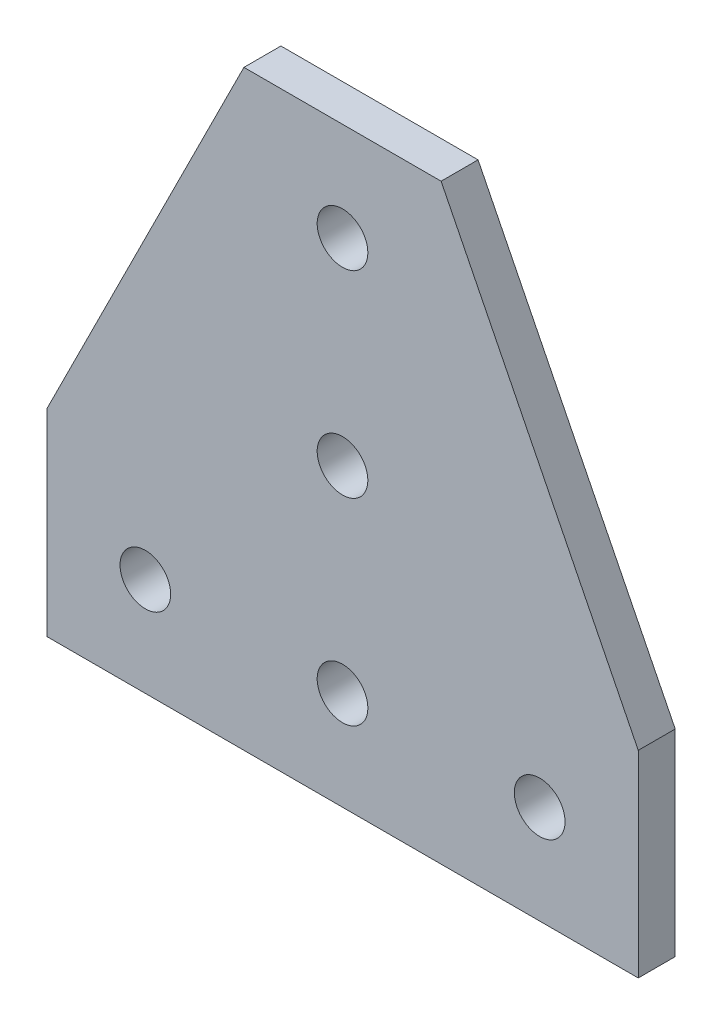
ISO-10303-21;
HEADER;
FILE_DESCRIPTION(('STEP AP214'),'2;1');
FILE_NAME('part.step','',(''),(''),'','','');
FILE_SCHEMA(('AUTOMOTIVE_DESIGN { 1 0 10303 214 1 1 1 1 }'));
ENDSEC;
DATA;
#1=APPLICATION_CONTEXT('core data for automotive mechanical design processes');
#2=APPLICATION_PROTOCOL_DEFINITION('international standard','automotive_design',2000,#1);
#3=PRODUCT_CONTEXT('',#1,'mechanical');
#4=PRODUCT('Part','Part','',(#3));
#5=PRODUCT_RELATED_PRODUCT_CATEGORY('part','',(#4));
#6=PRODUCT_DEFINITION_FORMATION('','',#4);
#7=PRODUCT_DEFINITION_CONTEXT('part definition',#1,'design');
#8=PRODUCT_DEFINITION('design','',#6,#7);
#9=PRODUCT_DEFINITION_SHAPE('','',#8);
#10=(LENGTH_UNIT() NAMED_UNIT(*) SI_UNIT(.MILLI.,.METRE.));
#11=(NAMED_UNIT(*) PLANE_ANGLE_UNIT() SI_UNIT($,.RADIAN.));
#12=(NAMED_UNIT(*) SI_UNIT($,.STERADIAN.) SOLID_ANGLE_UNIT());
#13=UNCERTAINTY_MEASURE_WITH_UNIT(LENGTH_MEASURE(1.E-05),#10,'distance_accuracy_value','');
#14=(GEOMETRIC_REPRESENTATION_CONTEXT(3) GLOBAL_UNCERTAINTY_ASSIGNED_CONTEXT((#13)) GLOBAL_UNIT_ASSIGNED_CONTEXT((#10,
#11,#12)) REPRESENTATION_CONTEXT('',''));
#15=CARTESIAN_POINT('',(0.,0.,0.));
#16=DIRECTION('',(0.,0.,1.));
#17=DIRECTION('',(1.,0.,0.));
#18=AXIS2_PLACEMENT_3D('',#15,#16,#17);
#19=CARTESIAN_POINT('',(0.,0.,2.38125));
#20=DIRECTION('',(0.,0.,-1.));
#21=DIRECTION('',(-1.,0.,0.));
#22=AXIS2_PLACEMENT_3D('',#19,#20,#21);
#23=PLANE('',#22);
#24=CARTESIAN_POINT('',(38.1,63.5,2.38125));
#25=DIRECTION('',(0.,0.,1.));
#26=DIRECTION('',(1.,0.,0.));
#27=AXIS2_PLACEMENT_3D('',#24,#25,#26);
#28=CIRCLE('',#27,3.26390000000001);
#29=CARTESIAN_POINT('',(41.3639,63.5,2.38125));
#30=VERTEX_POINT('',#29);
#31=EDGE_CURVE('E200',#30,#30,#28,.T.);
#32=ORIENTED_EDGE('',*,*,#31,.F.);
#33=EDGE_LOOP('',(#32));
#34=FACE_BOUND('',#33,.T.);
#35=CARTESIAN_POINT('',(38.1,12.7,2.38125));
#36=DIRECTION('',(0.,0.,1.));
#37=DIRECTION('',(1.,0.,0.));
#38=AXIS2_PLACEMENT_3D('',#35,#36,#37);
#39=CIRCLE('',#38,3.26389999999999);
#40=CARTESIAN_POINT('',(41.3639,12.7,2.38125));
#41=VERTEX_POINT('',#40);
#42=EDGE_CURVE('E212',#41,#41,#39,.T.);
#43=ORIENTED_EDGE('',*,*,#42,.F.);
#44=EDGE_LOOP('',(#43));
#45=FACE_BOUND('',#44,.T.);
#46=DIRECTION('',(1.,0.,0.));
#47=VECTOR('',#46,1.);
#48=CARTESIAN_POINT('',(76.2,0.,2.38125));
#49=LINE('',#48,#47);
#50=CARTESIAN_POINT('',(0.,0.,2.38125));
#51=VERTEX_POINT('',#50);
#52=CARTESIAN_POINT('',(76.2,0.,2.38125));
#53=VERTEX_POINT('',#52);
#54=EDGE_CURVE('E135',#51,#53,#49,.T.);
#55=ORIENTED_EDGE('',*,*,#54,.T.);
#56=DIRECTION('',(0.,1.,0.));
#57=VECTOR('',#56,1.);
#58=CARTESIAN_POINT('',(76.2,25.4,2.38125));
#59=LINE('',#58,#57);
#60=CARTESIAN_POINT('',(76.2,25.4,2.38125));
#61=VERTEX_POINT('',#60);
#62=EDGE_CURVE('E93',#53,#61,#59,.T.);
#63=ORIENTED_EDGE('',*,*,#62,.T.);
#64=DIRECTION('',(-0.447213595499958,0.894427190999916,0.));
#65=VECTOR('',#64,1.);
#66=CARTESIAN_POINT('',(76.2,25.4,2.38125));
#67=LINE('',#66,#65);
#68=CARTESIAN_POINT('',(50.8,76.2,2.38125));
#69=VERTEX_POINT('',#68);
#70=EDGE_CURVE('E106',#61,#69,#67,.T.);
#71=ORIENTED_EDGE('',*,*,#70,.T.);
#72=DIRECTION('',(-1.,0.,0.));
#73=VECTOR('',#72,1.);
#74=CARTESIAN_POINT('',(25.4,76.2,2.38125));
#75=LINE('',#74,#73);
#76=CARTESIAN_POINT('',(25.4,76.2,2.38125));
#77=VERTEX_POINT('',#76);
#78=EDGE_CURVE('E100',#69,#77,#75,.T.);
#79=ORIENTED_EDGE('',*,*,#78,.T.);
#80=DIRECTION('',(-0.447213595499958,-0.894427190999916,0.));
#81=VECTOR('',#80,1.);
#82=CARTESIAN_POINT('',(0.,25.4,2.38125));
#83=LINE('',#82,#81);
#84=CARTESIAN_POINT('',(0.,25.4,2.38125));
#85=VERTEX_POINT('',#84);
#86=EDGE_CURVE('E104',#77,#85,#83,.T.);
#87=ORIENTED_EDGE('',*,*,#86,.T.);
#88=DIRECTION('',(0.,-1.,0.));
#89=VECTOR('',#88,1.);
#90=CARTESIAN_POINT('',(0.,0.,2.38125));
#91=LINE('',#90,#89);
#92=EDGE_CURVE('E56',#85,#51,#91,.T.);
#93=ORIENTED_EDGE('',*,*,#92,.T.);
#94=EDGE_LOOP('',(#55,#63,#71,#79,#87,#93));
#95=FACE_BOUND('',#94,.T.);
#96=CARTESIAN_POINT('',(12.7,12.7,2.38125));
#97=DIRECTION('',(0.,0.,1.));
#98=DIRECTION('',(1.,0.,0.));
#99=AXIS2_PLACEMENT_3D('',#96,#97,#98);
#100=CIRCLE('',#99,3.2639);
#101=CARTESIAN_POINT('',(15.9639,12.7,2.38125));
#102=VERTEX_POINT('',#101);
#103=EDGE_CURVE('E128',#102,#102,#100,.T.);
#104=ORIENTED_EDGE('',*,*,#103,.F.);
#105=EDGE_LOOP('',(#104));
#106=FACE_BOUND('',#105,.T.);
#107=CARTESIAN_POINT('',(63.5,12.7,2.38125));
#108=DIRECTION('',(0.,0.,1.));
#109=DIRECTION('',(1.,0.,0.));
#110=AXIS2_PLACEMENT_3D('',#107,#108,#109);
#111=CIRCLE('',#110,3.26389999999999);
#112=CARTESIAN_POINT('',(66.7639,12.7,2.38125));
#113=VERTEX_POINT('',#112);
#114=EDGE_CURVE('E206',#113,#113,#111,.T.);
#115=ORIENTED_EDGE('',*,*,#114,.F.);
#116=EDGE_LOOP('',(#115));
#117=FACE_BOUND('',#116,.T.);
#118=CARTESIAN_POINT('',(38.1,38.1,2.38125));
#119=DIRECTION('',(0.,0.,1.));
#120=DIRECTION('',(1.,0.,0.));
#121=AXIS2_PLACEMENT_3D('',#118,#119,#120);
#122=CIRCLE('',#121,3.26389999999999);
#123=CARTESIAN_POINT('',(41.3639,38.1,2.38125));
#124=VERTEX_POINT('',#123);
#125=EDGE_CURVE('E191',#124,#124,#122,.T.);
#126=ORIENTED_EDGE('',*,*,#125,.F.);
#127=EDGE_LOOP('',(#126));
#128=FACE_BOUND('',#127,.T.);
#129=ADVANCED_FACE('F39',(#34,#45,#95,#106,#117,#128),#23,.F.);
#130=CARTESIAN_POINT('',(0.,0.,-2.38125));
#131=DIRECTION('',(0.,0.,-1.));
#132=DIRECTION('',(-1.,0.,0.));
#133=AXIS2_PLACEMENT_3D('',#130,#131,#132);
#134=PLANE('',#133);
#135=CARTESIAN_POINT('',(38.1,63.5,-2.38125));
#136=DIRECTION('',(0.,0.,1.));
#137=DIRECTION('',(1.,0.,0.));
#138=AXIS2_PLACEMENT_3D('',#135,#136,#137);
#139=CIRCLE('',#138,3.26390000000001);
#140=CARTESIAN_POINT('',(41.3639,63.5,-2.38125));
#141=VERTEX_POINT('',#140);
#142=EDGE_CURVE('E197',#141,#141,#139,.T.);
#143=ORIENTED_EDGE('',*,*,#142,.T.);
#144=EDGE_LOOP('',(#143));
#145=FACE_BOUND('',#144,.T.);
#146=CARTESIAN_POINT('',(38.1,12.7,-2.38125));
#147=DIRECTION('',(0.,0.,1.));
#148=DIRECTION('',(1.,0.,0.));
#149=AXIS2_PLACEMENT_3D('',#146,#147,#148);
#150=CIRCLE('',#149,3.26389999999999);
#151=CARTESIAN_POINT('',(41.3639,12.7,-2.38125));
#152=VERTEX_POINT('',#151);
#153=EDGE_CURVE('E209',#152,#152,#150,.T.);
#154=ORIENTED_EDGE('',*,*,#153,.T.);
#155=EDGE_LOOP('',(#154));
#156=FACE_BOUND('',#155,.T.);
#157=DIRECTION('',(1.,0.,0.));
#158=VECTOR('',#157,1.);
#159=CARTESIAN_POINT('',(76.2,0.,-2.38125));
#160=LINE('',#159,#158);
#161=CARTESIAN_POINT('',(0.,0.,-2.38125));
#162=VERTEX_POINT('',#161);
#163=CARTESIAN_POINT('',(76.2,0.,-2.38125));
#164=VERTEX_POINT('',#163);
#165=EDGE_CURVE('E124',#162,#164,#160,.T.);
#166=ORIENTED_EDGE('',*,*,#165,.F.);
#167=DIRECTION('',(0.,-1.,0.));
#168=VECTOR('',#167,1.);
#169=CARTESIAN_POINT('',(0.,0.,-2.38125));
#170=LINE('',#169,#168);
#171=CARTESIAN_POINT('',(0.,25.4,-2.38125));
#172=VERTEX_POINT('',#171);
#173=EDGE_CURVE('E85',#172,#162,#170,.T.);
#174=ORIENTED_EDGE('',*,*,#173,.F.);
#175=DIRECTION('',(-0.447213595499958,-0.894427190999916,0.));
#176=VECTOR('',#175,1.);
#177=CARTESIAN_POINT('',(0.,25.4,-2.38125));
#178=LINE('',#177,#176);
#179=CARTESIAN_POINT('',(25.4,76.2,-2.38125));
#180=VERTEX_POINT('',#179);
#181=EDGE_CURVE('E79',#180,#172,#178,.T.);
#182=ORIENTED_EDGE('',*,*,#181,.F.);
#183=DIRECTION('',(-1.,0.,0.));
#184=VECTOR('',#183,1.);
#185=CARTESIAN_POINT('',(25.4,76.2,-2.38125));
#186=LINE('',#185,#184);
#187=CARTESIAN_POINT('',(50.8,76.2,-2.38125));
#188=VERTEX_POINT('',#187);
#189=EDGE_CURVE('E114',#188,#180,#186,.T.);
#190=ORIENTED_EDGE('',*,*,#189,.F.);
#191=DIRECTION('',(-0.447213595499958,0.894427190999916,0.));
#192=VECTOR('',#191,1.);
#193=CARTESIAN_POINT('',(76.2,25.4,-2.38125));
#194=LINE('',#193,#192);
#195=CARTESIAN_POINT('',(76.2,25.4,-2.38125));
#196=VERTEX_POINT('',#195);
#197=EDGE_CURVE('E130',#196,#188,#194,.T.);
#198=ORIENTED_EDGE('',*,*,#197,.F.);
#199=DIRECTION('',(0.,1.,0.));
#200=VECTOR('',#199,1.);
#201=CARTESIAN_POINT('',(76.2,25.4,-2.38125));
#202=LINE('',#201,#200);
#203=EDGE_CURVE('E127',#164,#196,#202,.T.);
#204=ORIENTED_EDGE('',*,*,#203,.F.);
#205=EDGE_LOOP('',(#166,#174,#182,#190,#198,#204));
#206=FACE_BOUND('',#205,.T.);
#207=CARTESIAN_POINT('',(12.7,12.7,-2.38125));
#208=DIRECTION('',(0.,0.,1.));
#209=DIRECTION('',(1.,0.,0.));
#210=AXIS2_PLACEMENT_3D('',#207,#208,#209);
#211=CIRCLE('',#210,3.2639);
#212=CARTESIAN_POINT('',(15.9639,12.7,-2.38125));
#213=VERTEX_POINT('',#212);
#214=EDGE_CURVE('E215',#213,#213,#211,.T.);
#215=ORIENTED_EDGE('',*,*,#214,.T.);
#216=EDGE_LOOP('',(#215));
#217=FACE_BOUND('',#216,.T.);
#218=CARTESIAN_POINT('',(63.5,12.7,-2.38125));
#219=DIRECTION('',(0.,0.,1.));
#220=DIRECTION('',(1.,0.,0.));
#221=AXIS2_PLACEMENT_3D('',#218,#219,#220);
#222=CIRCLE('',#221,3.26389999999999);
#223=CARTESIAN_POINT('',(66.7639,12.7,-2.38125));
#224=VERTEX_POINT('',#223);
#225=EDGE_CURVE('E203',#224,#224,#222,.T.);
#226=ORIENTED_EDGE('',*,*,#225,.T.);
#227=EDGE_LOOP('',(#226));
#228=FACE_BOUND('',#227,.T.);
#229=CARTESIAN_POINT('',(38.1,38.1,-2.38125));
#230=DIRECTION('',(0.,0.,1.));
#231=DIRECTION('',(1.,0.,0.));
#232=AXIS2_PLACEMENT_3D('',#229,#230,#231);
#233=CIRCLE('',#232,3.26389999999999);
#234=CARTESIAN_POINT('',(41.3639,38.1,-2.38125));
#235=VERTEX_POINT('',#234);
#236=EDGE_CURVE('E194',#235,#235,#233,.T.);
#237=ORIENTED_EDGE('',*,*,#236,.T.);
#238=EDGE_LOOP('',(#237));
#239=FACE_BOUND('',#238,.T.);
#240=ADVANCED_FACE('F144',(#145,#156,#206,#217,#228,#239),#134,.T.);
#241=CARTESIAN_POINT('',(76.2,0.,2.38125));
#242=DIRECTION('',(0.,1.,0.));
#243=DIRECTION('',(-1.,0.,0.));
#244=AXIS2_PLACEMENT_3D('',#241,#242,#243);
#245=PLANE('',#244);
#246=ORIENTED_EDGE('',*,*,#165,.T.);
#247=DIRECTION('',(0.,0.,-1.));
#248=VECTOR('',#247,1.);
#249=CARTESIAN_POINT('',(76.2,0.,2.38125));
#250=LINE('',#249,#248);
#251=EDGE_CURVE('E11',#53,#164,#250,.T.);
#252=ORIENTED_EDGE('',*,*,#251,.F.);
#253=ORIENTED_EDGE('',*,*,#54,.F.);
#254=DIRECTION('',(0.,0.,-1.));
#255=VECTOR('',#254,1.);
#256=CARTESIAN_POINT('',(0.,0.,2.38125));
#257=LINE('',#256,#255);
#258=EDGE_CURVE('E120',#51,#162,#257,.T.);
#259=ORIENTED_EDGE('',*,*,#258,.T.);
#260=EDGE_LOOP('',(#246,#252,#253,#259));
#261=FACE_BOUND('',#260,.T.);
#262=ADVANCED_FACE('F41',(#261),#245,.F.);
#263=CARTESIAN_POINT('',(76.2,25.4,2.38125));
#264=DIRECTION('',(-1.,0.,0.));
#265=DIRECTION('',(0.,0.,1.));
#266=AXIS2_PLACEMENT_3D('',#263,#264,#265);
#267=PLANE('',#266);
#268=ORIENTED_EDGE('',*,*,#203,.T.);
#269=DIRECTION('',(0.,0.,-1.));
#270=VECTOR('',#269,1.);
#271=CARTESIAN_POINT('',(76.2,25.4,2.38125));
#272=LINE('',#271,#270);
#273=EDGE_CURVE('E48',#61,#196,#272,.T.);
#274=ORIENTED_EDGE('',*,*,#273,.F.);
#275=ORIENTED_EDGE('',*,*,#62,.F.);
#276=ORIENTED_EDGE('',*,*,#251,.T.);
#277=EDGE_LOOP('',(#268,#274,#275,#276));
#278=FACE_BOUND('',#277,.T.);
#279=ADVANCED_FACE('F281',(#278),#267,.F.);
#280=CARTESIAN_POINT('',(76.2,25.4,2.38125));
#281=DIRECTION('',(-0.894427190999916,-0.447213595499958,0.));
#282=DIRECTION('',(0.447213595499958,-0.894427190999916,0.));
#283=AXIS2_PLACEMENT_3D('',#280,#281,#282);
#284=PLANE('',#283);
#285=ORIENTED_EDGE('',*,*,#197,.T.);
#286=DIRECTION('',(0.,0.,-1.));
#287=VECTOR('',#286,1.);
#288=CARTESIAN_POINT('',(50.8,76.2,2.38125));
#289=LINE('',#288,#287);
#290=EDGE_CURVE('E115',#69,#188,#289,.T.);
#291=ORIENTED_EDGE('',*,*,#290,.F.);
#292=ORIENTED_EDGE('',*,*,#70,.F.);
#293=ORIENTED_EDGE('',*,*,#273,.T.);
#294=EDGE_LOOP('',(#285,#291,#292,#293));
#295=FACE_BOUND('',#294,.T.);
#296=ADVANCED_FACE('F141',(#295),#284,.F.);
#297=CARTESIAN_POINT('',(25.4,76.2,2.38125));
#298=DIRECTION('',(0.,-1.,0.));
#299=DIRECTION('',(0.,0.,-1.));
#300=AXIS2_PLACEMENT_3D('',#297,#298,#299);
#301=PLANE('',#300);
#302=ORIENTED_EDGE('',*,*,#189,.T.);
#303=DIRECTION('',(0.,0.,-1.));
#304=VECTOR('',#303,1.);
#305=CARTESIAN_POINT('',(25.4,76.2,2.38125));
#306=LINE('',#305,#304);
#307=EDGE_CURVE('E111',#77,#180,#306,.T.);
#308=ORIENTED_EDGE('',*,*,#307,.F.);
#309=ORIENTED_EDGE('',*,*,#78,.F.);
#310=ORIENTED_EDGE('',*,*,#290,.T.);
#311=EDGE_LOOP('',(#302,#308,#309,#310));
#312=FACE_BOUND('',#311,.T.);
#313=ADVANCED_FACE('F112',(#312),#301,.F.);
#314=CARTESIAN_POINT('',(0.,25.4,2.38125));
#315=DIRECTION('',(0.894427190999916,-0.447213595499958,0.));
#316=DIRECTION('',(0.447213595499958,0.894427190999916,0.));
#317=AXIS2_PLACEMENT_3D('',#314,#315,#316);
#318=PLANE('',#317);
#319=ORIENTED_EDGE('',*,*,#181,.T.);
#320=DIRECTION('',(0.,0.,-1.));
#321=VECTOR('',#320,1.);
#322=CARTESIAN_POINT('',(0.,25.4,2.38125));
#323=LINE('',#322,#321);
#324=EDGE_CURVE('E116',#85,#172,#323,.T.);
#325=ORIENTED_EDGE('',*,*,#324,.F.);
#326=ORIENTED_EDGE('',*,*,#86,.F.);
#327=ORIENTED_EDGE('',*,*,#307,.T.);
#328=EDGE_LOOP('',(#319,#325,#326,#327));
#329=FACE_BOUND('',#328,.T.);
#330=ADVANCED_FACE('F118',(#329),#318,.F.);
#331=CARTESIAN_POINT('',(0.,0.,2.38125));
#332=DIRECTION('',(1.,0.,0.));
#333=DIRECTION('',(0.,0.,-1.));
#334=AXIS2_PLACEMENT_3D('',#331,#332,#333);
#335=PLANE('',#334);
#336=ORIENTED_EDGE('',*,*,#173,.T.);
#337=ORIENTED_EDGE('',*,*,#258,.F.);
#338=ORIENTED_EDGE('',*,*,#92,.F.);
#339=ORIENTED_EDGE('',*,*,#324,.T.);
#340=EDGE_LOOP('',(#336,#337,#338,#339));
#341=FACE_BOUND('',#340,.T.);
#342=ADVANCED_FACE('F149',(#341),#335,.F.);
#343=CARTESIAN_POINT('',(12.7,12.7,2.38125));
#344=DIRECTION('',(0.,0.,-1.));
#345=DIRECTION('',(-1.,0.,0.));
#346=AXIS2_PLACEMENT_3D('',#343,#344,#345);
#347=CYLINDRICAL_SURFACE('',#346,3.2639);
#348=ORIENTED_EDGE('',*,*,#103,.T.);
#349=EDGE_LOOP('',(#348));
#350=FACE_BOUND('',#349,.T.);
#351=ORIENTED_EDGE('',*,*,#214,.F.);
#352=EDGE_LOOP('',(#351));
#353=FACE_BOUND('',#352,.T.);
#354=ADVANCED_FACE('F151',(#350,#353),#347,.F.);
#355=CARTESIAN_POINT('',(38.1,12.7,2.38125));
#356=DIRECTION('',(0.,0.,-1.));
#357=DIRECTION('',(-1.,0.,0.));
#358=AXIS2_PLACEMENT_3D('',#355,#356,#357);
#359=CYLINDRICAL_SURFACE('',#358,3.26389999999999);
#360=ORIENTED_EDGE('',*,*,#42,.T.);
#361=EDGE_LOOP('',(#360));
#362=FACE_BOUND('',#361,.T.);
#363=ORIENTED_EDGE('',*,*,#153,.F.);
#364=EDGE_LOOP('',(#363));
#365=FACE_BOUND('',#364,.T.);
#366=ADVANCED_FACE('F157',(#362,#365),#359,.F.);
#367=CARTESIAN_POINT('',(63.5,12.7,2.38125));
#368=DIRECTION('',(0.,0.,-1.));
#369=DIRECTION('',(-1.,0.,0.));
#370=AXIS2_PLACEMENT_3D('',#367,#368,#369);
#371=CYLINDRICAL_SURFACE('',#370,3.26389999999999);
#372=ORIENTED_EDGE('',*,*,#114,.T.);
#373=EDGE_LOOP('',(#372));
#374=FACE_BOUND('',#373,.T.);
#375=ORIENTED_EDGE('',*,*,#225,.F.);
#376=EDGE_LOOP('',(#375));
#377=FACE_BOUND('',#376,.T.);
#378=ADVANCED_FACE('F174',(#374,#377),#371,.F.);
#379=CARTESIAN_POINT('',(38.1,63.5,2.38125));
#380=DIRECTION('',(0.,0.,-1.));
#381=DIRECTION('',(-1.,0.,0.));
#382=AXIS2_PLACEMENT_3D('',#379,#380,#381);
#383=CYLINDRICAL_SURFACE('',#382,3.26390000000001);
#384=ORIENTED_EDGE('',*,*,#31,.T.);
#385=EDGE_LOOP('',(#384));
#386=FACE_BOUND('',#385,.T.);
#387=ORIENTED_EDGE('',*,*,#142,.F.);
#388=EDGE_LOOP('',(#387));
#389=FACE_BOUND('',#388,.T.);
#390=ADVANCED_FACE('F178',(#386,#389),#383,.F.);
#391=CARTESIAN_POINT('',(38.1,38.1,2.38125));
#392=DIRECTION('',(0.,0.,-1.));
#393=DIRECTION('',(-1.,0.,0.));
#394=AXIS2_PLACEMENT_3D('',#391,#392,#393);
#395=CYLINDRICAL_SURFACE('',#394,3.26389999999999);
#396=ORIENTED_EDGE('',*,*,#125,.T.);
#397=EDGE_LOOP('',(#396));
#398=FACE_BOUND('',#397,.T.);
#399=ORIENTED_EDGE('',*,*,#236,.F.);
#400=EDGE_LOOP('',(#399));
#401=FACE_BOUND('',#400,.T.);
#402=ADVANCED_FACE('F182',(#398,#401),#395,.F.);
#403=CLOSED_SHELL('',(#129,#240,#262,#279,#296,#313,#330,#342,#354,#366,#378,#390,#402));
#404=MANIFOLD_SOLID_BREP('B2',#403);
#405=ADVANCED_BREP_SHAPE_REPRESENTATION('',(#18,#404),#14);
#406=SHAPE_DEFINITION_REPRESENTATION(#9,#405);
ENDSEC;
END-ISO-10303-21;
